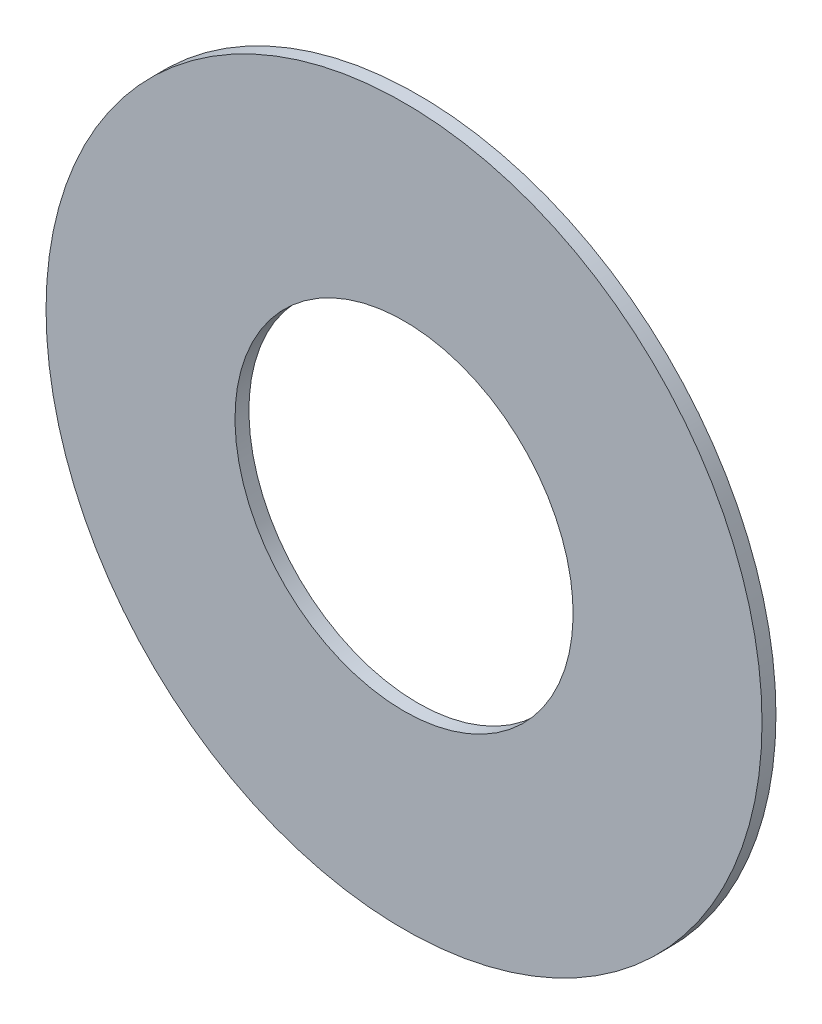
ISO-10303-21;
HEADER;
FILE_DESCRIPTION(('STEP AP214'),'2;1');
FILE_NAME('part.step','',(''),(''),'','','');
FILE_SCHEMA(('AUTOMOTIVE_DESIGN { 1 0 10303 214 1 1 1 1 }'));
ENDSEC;
DATA;
#1=APPLICATION_CONTEXT('core data for automotive mechanical design processes');
#2=APPLICATION_PROTOCOL_DEFINITION('international standard','automotive_design',2000,#1);
#3=PRODUCT_CONTEXT('',#1,'mechanical');
#4=PRODUCT('Part','Part','',(#3));
#5=PRODUCT_RELATED_PRODUCT_CATEGORY('part','',(#4));
#6=PRODUCT_DEFINITION_FORMATION('','',#4);
#7=PRODUCT_DEFINITION_CONTEXT('part definition',#1,'design');
#8=PRODUCT_DEFINITION('design','',#6,#7);
#9=PRODUCT_DEFINITION_SHAPE('','',#8);
#10=(LENGTH_UNIT() NAMED_UNIT(*) SI_UNIT(.MILLI.,.METRE.));
#11=(NAMED_UNIT(*) PLANE_ANGLE_UNIT() SI_UNIT($,.RADIAN.));
#12=(NAMED_UNIT(*) SI_UNIT($,.STERADIAN.) SOLID_ANGLE_UNIT());
#13=UNCERTAINTY_MEASURE_WITH_UNIT(LENGTH_MEASURE(1.E-05),#10,'distance_accuracy_value','');
#14=(GEOMETRIC_REPRESENTATION_CONTEXT(3) GLOBAL_UNCERTAINTY_ASSIGNED_CONTEXT((#13)) GLOBAL_UNIT_ASSIGNED_CONTEXT((#10,
#11,#12)) REPRESENTATION_CONTEXT('',''));
#15=CARTESIAN_POINT('',(0.,0.,0.));
#16=DIRECTION('',(0.,0.,1.));
#17=DIRECTION('',(1.,0.,0.));
#18=AXIS2_PLACEMENT_3D('',#15,#16,#17);
#19=CARTESIAN_POINT('',(170.3578,-71.2108,-0.045));
#20=DIRECTION('',(0.,0.,-1.));
#21=DIRECTION('',(0.,-1.,0.));
#22=AXIS2_PLACEMENT_3D('',#19,#20,#21);
#23=CYLINDRICAL_SURFACE('',#22,0.425);
#24=CARTESIAN_POINT('',(170.3578,-71.2108,1.67));
#25=DIRECTION('',(0.,0.,-1.));
#26=DIRECTION('',(0.,-1.,0.));
#27=AXIS2_PLACEMENT_3D('',#24,#25,#26);
#28=CIRCLE('',#27,0.425);
#29=CARTESIAN_POINT('',(170.3578,-71.6358,1.67));
#30=VERTEX_POINT('',#29);
#31=EDGE_CURVE('E25',#30,#30,#28,.T.);
#32=ORIENTED_EDGE('',*,*,#31,.T.);
#33=DIRECTION('',(0.,0.,1.));
#34=VECTOR('',#33,1.);
#35=CARTESIAN_POINT('',(170.3578,-71.6358,-0.045));
#36=LINE('',#35,#34);
#37=CARTESIAN_POINT('',(170.3578,-71.6358,1.705));
#38=VERTEX_POINT('',#37);
#39=EDGE_CURVE('E11',#30,#38,#36,.T.);
#40=ORIENTED_EDGE('',*,*,#39,.T.);
#41=CARTESIAN_POINT('',(170.3578,-71.2108,1.705));
#42=DIRECTION('',(0.,0.,-1.));
#43=DIRECTION('',(0.,-1.,0.));
#44=AXIS2_PLACEMENT_3D('',#41,#42,#43);
#45=CIRCLE('',#44,0.425);
#46=EDGE_CURVE('E69',#38,#38,#45,.T.);
#47=ORIENTED_EDGE('',*,*,#46,.F.);
#48=ORIENTED_EDGE('',*,*,#39,.F.);
#49=EDGE_LOOP('',(#32,#40,#47,#48));
#50=FACE_BOUND('',#49,.T.);
#51=ADVANCED_FACE('F17',(#50),#23,.F.);
#52=CARTESIAN_POINT('',(170.3578,-71.2108,1.67));
#53=DIRECTION('',(0.,0.,1.));
#54=DIRECTION('',(1.,0.,0.));
#55=AXIS2_PLACEMENT_3D('',#52,#53,#54);
#56=PLANE('',#55);
#57=ORIENTED_EDGE('',*,*,#31,.F.);
#58=EDGE_LOOP('',(#57));
#59=FACE_BOUND('',#58,.T.);
#60=CARTESIAN_POINT('',(170.3578,-71.2108,1.67));
#61=DIRECTION('',(0.,0.,1.));
#62=DIRECTION('',(1.,0.,0.));
#63=AXIS2_PLACEMENT_3D('',#60,#61,#62);
#64=CIRCLE('',#63,0.9);
#65=CARTESIAN_POINT('',(171.2578,-71.2108,1.67));
#66=VERTEX_POINT('',#65);
#67=EDGE_CURVE('E56',#66,#66,#64,.T.);
#68=ORIENTED_EDGE('',*,*,#67,.F.);
#69=EDGE_LOOP('',(#68));
#70=FACE_BOUND('',#69,.T.);
#71=ADVANCED_FACE('F76',(#59,#70),#56,.F.);
#72=CARTESIAN_POINT('',(170.3578,-71.2108,1.705));
#73=DIRECTION('',(0.,0.,1.));
#74=DIRECTION('',(1.,0.,0.));
#75=AXIS2_PLACEMENT_3D('',#72,#73,#74);
#76=PLANE('',#75);
#77=ORIENTED_EDGE('',*,*,#46,.T.);
#78=EDGE_LOOP('',(#77));
#79=FACE_BOUND('',#78,.T.);
#80=CARTESIAN_POINT('',(170.3578,-71.2108,1.705));
#81=DIRECTION('',(0.,0.,1.));
#82=DIRECTION('',(1.,0.,0.));
#83=AXIS2_PLACEMENT_3D('',#80,#81,#82);
#84=CIRCLE('',#83,0.9);
#85=CARTESIAN_POINT('',(171.2578,-71.2108,1.705));
#86=VERTEX_POINT('',#85);
#87=EDGE_CURVE('E54',#86,#86,#84,.T.);
#88=ORIENTED_EDGE('',*,*,#87,.T.);
#89=EDGE_LOOP('',(#88));
#90=FACE_BOUND('',#89,.T.);
#91=ADVANCED_FACE('F60',(#79,#90),#76,.T.);
#92=CARTESIAN_POINT('',(170.3578,-71.2108,1.67));
#93=DIRECTION('',(0.,0.,1.));
#94=DIRECTION('',(1.,0.,0.));
#95=AXIS2_PLACEMENT_3D('',#92,#93,#94);
#96=CYLINDRICAL_SURFACE('',#95,0.9);
#97=ORIENTED_EDGE('',*,*,#87,.F.);
#98=DIRECTION('',(0.,0.,1.));
#99=VECTOR('',#98,1.);
#100=CARTESIAN_POINT('',(171.2578,-71.2108,1.67));
#101=LINE('',#100,#99);
#102=EDGE_CURVE('E51',#66,#86,#101,.T.);
#103=ORIENTED_EDGE('',*,*,#102,.F.);
#104=ORIENTED_EDGE('',*,*,#67,.T.);
#105=ORIENTED_EDGE('',*,*,#102,.T.);
#106=EDGE_LOOP('',(#97,#103,#104,#105));
#107=FACE_BOUND('',#106,.T.);
#108=ADVANCED_FACE('F53',(#107),#96,.T.);
#109=CLOSED_SHELL('',(#51,#71,#91,#108));
#110=MANIFOLD_SOLID_BREP('B1',#109);
#111=ADVANCED_BREP_SHAPE_REPRESENTATION('',(#18,#110),#14);
#112=SHAPE_DEFINITION_REPRESENTATION(#9,#111);
ENDSEC;
END-ISO-10303-21;
